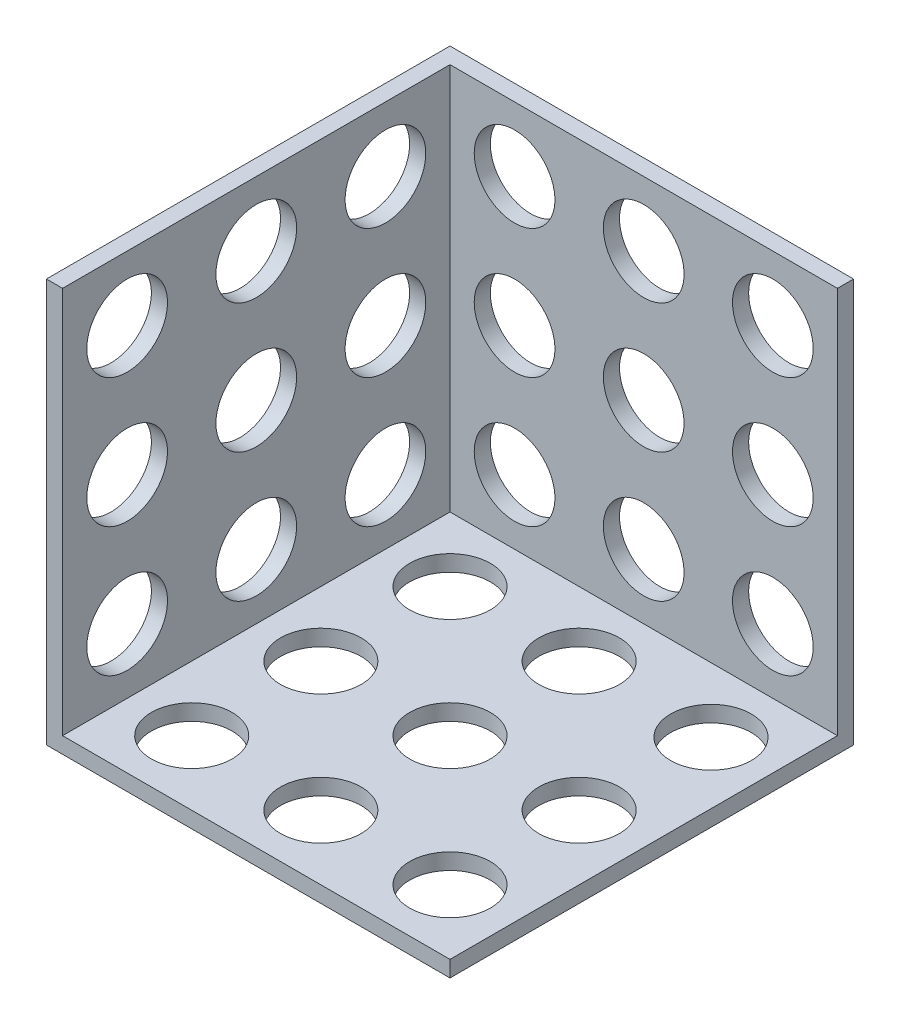
ISO-10303-21;
HEADER;
FILE_DESCRIPTION(('STEP AP214'),'2;1');
FILE_NAME('part.step','',(''),(''),'','','');
FILE_SCHEMA(('AUTOMOTIVE_DESIGN { 1 0 10303 214 1 1 1 1 }'));
ENDSEC;
DATA;
#1=APPLICATION_CONTEXT('core data for automotive mechanical design processes');
#2=APPLICATION_PROTOCOL_DEFINITION('international standard','automotive_design',2000,#1);
#3=PRODUCT_CONTEXT('',#1,'mechanical');
#4=PRODUCT('Part','Part','',(#3));
#5=PRODUCT_RELATED_PRODUCT_CATEGORY('part','',(#4));
#6=PRODUCT_DEFINITION_FORMATION('','',#4);
#7=PRODUCT_DEFINITION_CONTEXT('part definition',#1,'design');
#8=PRODUCT_DEFINITION('design','',#6,#7);
#9=PRODUCT_DEFINITION_SHAPE('','',#8);
#10=(LENGTH_UNIT() NAMED_UNIT(*) SI_UNIT(.MILLI.,.METRE.));
#11=(NAMED_UNIT(*) PLANE_ANGLE_UNIT() SI_UNIT($,.RADIAN.));
#12=(NAMED_UNIT(*) SI_UNIT($,.STERADIAN.) SOLID_ANGLE_UNIT());
#13=UNCERTAINTY_MEASURE_WITH_UNIT(LENGTH_MEASURE(1.E-05),#10,'distance_accuracy_value','');
#14=(GEOMETRIC_REPRESENTATION_CONTEXT(3) GLOBAL_UNCERTAINTY_ASSIGNED_CONTEXT((#13)) GLOBAL_UNIT_ASSIGNED_CONTEXT((#10,
#11,#12)) REPRESENTATION_CONTEXT('',''));
#15=CARTESIAN_POINT('',(0.,0.,0.));
#16=DIRECTION('',(0.,0.,1.));
#17=DIRECTION('',(1.,0.,0.));
#18=AXIS2_PLACEMENT_3D('',#15,#16,#17);
#19=CARTESIAN_POINT('',(240.,10.,0.));
#20=DIRECTION('',(-1.,0.,0.));
#21=DIRECTION('',(0.,0.,1.));
#22=AXIS2_PLACEMENT_3D('',#19,#20,#21);
#23=PLANE('',#22);
#24=DIRECTION('',(0.,0.,-1.));
#25=VECTOR('',#24,1.);
#26=CARTESIAN_POINT('',(240.,0.,0.));
#27=LINE('',#26,#25);
#28=CARTESIAN_POINT('',(240.,0.,80.));
#29=VERTEX_POINT('',#28);
#30=CARTESIAN_POINT('',(240.,0.,-170.));
#31=VERTEX_POINT('',#30);
#32=EDGE_CURVE('E196',#29,#31,#27,.T.);
#33=ORIENTED_EDGE('',*,*,#32,.T.);
#34=DIRECTION('',(0.,1.,0.));
#35=VECTOR('',#34,1.);
#36=CARTESIAN_POINT('',(240.,-4.16333634234434E-13,-170.));
#37=LINE('',#36,#35);
#38=CARTESIAN_POINT('',(240.,250.,-170.));
#39=VERTEX_POINT('',#38);
#40=EDGE_CURVE('E200',#31,#39,#37,.T.);
#41=ORIENTED_EDGE('',*,*,#40,.T.);
#42=DIRECTION('',(0.,0.,1.));
#43=VECTOR('',#42,1.);
#44=CARTESIAN_POINT('',(240.,250.,-170.));
#45=LINE('',#44,#43);
#46=CARTESIAN_POINT('',(240.,250.,-160.));
#47=VERTEX_POINT('',#46);
#48=EDGE_CURVE('E204',#39,#47,#45,.T.);
#49=ORIENTED_EDGE('',*,*,#48,.T.);
#50=DIRECTION('',(0.,1.,0.));
#51=VECTOR('',#50,1.);
#52=CARTESIAN_POINT('',(240.,-4.16333634234434E-13,-160.));
#53=LINE('',#52,#51);
#54=CARTESIAN_POINT('',(240.,10.,-160.));
#55=VERTEX_POINT('',#54);
#56=EDGE_CURVE('E250',#55,#47,#53,.T.);
#57=ORIENTED_EDGE('',*,*,#56,.F.);
#58=DIRECTION('',(0.,0.,-1.));
#59=VECTOR('',#58,1.);
#60=CARTESIAN_POINT('',(240.,10.,0.));
#61=LINE('',#60,#59);
#62=CARTESIAN_POINT('',(240.,10.,80.));
#63=VERTEX_POINT('',#62);
#64=EDGE_CURVE('E262',#63,#55,#61,.T.);
#65=ORIENTED_EDGE('',*,*,#64,.F.);
#66=DIRECTION('',(0.,-1.,0.));
#67=VECTOR('',#66,1.);
#68=CARTESIAN_POINT('',(240.,10.,80.));
#69=LINE('',#68,#67);
#70=EDGE_CURVE('E11',#63,#29,#69,.T.);
#71=ORIENTED_EDGE('',*,*,#70,.T.);
#72=EDGE_LOOP('',(#33,#41,#49,#57,#65,#71));
#73=FACE_BOUND('',#72,.T.);
#74=ADVANCED_FACE('F35',(#73),#23,.F.);
#75=CARTESIAN_POINT('',(200.,10.,-40.));
#76=DIRECTION('',(0.,-1.,0.));
#77=DIRECTION('',(0.,0.,-1.));
#78=AXIS2_PLACEMENT_3D('',#75,#76,#77);
#79=CYLINDRICAL_SURFACE('',#78,25.);
#80=CARTESIAN_POINT('',(200.,10.,-40.));
#81=DIRECTION('',(0.,1.,0.));
#82=DIRECTION('',(0.,0.,1.));
#83=AXIS2_PLACEMENT_3D('',#80,#81,#82);
#84=CIRCLE('',#83,25.);
#85=CARTESIAN_POINT('',(200.,10.,-15.));
#86=VERTEX_POINT('',#85);
#87=EDGE_CURVE('E297',#86,#86,#84,.T.);
#88=ORIENTED_EDGE('',*,*,#87,.T.);
#89=EDGE_LOOP('',(#88));
#90=FACE_BOUND('',#89,.T.);
#91=CARTESIAN_POINT('',(200.,0.,-40.));
#92=DIRECTION('',(0.,1.,0.));
#93=DIRECTION('',(0.,0.,1.));
#94=AXIS2_PLACEMENT_3D('',#91,#92,#93);
#95=CIRCLE('',#94,25.);
#96=CARTESIAN_POINT('',(200.,0.,-15.));
#97=VERTEX_POINT('',#96);
#98=EDGE_CURVE('E324',#97,#97,#95,.T.);
#99=ORIENTED_EDGE('',*,*,#98,.F.);
#100=EDGE_LOOP('',(#99));
#101=FACE_BOUND('',#100,.T.);
#102=ADVANCED_FACE('F186',(#90,#101),#79,.F.);
#103=CARTESIAN_POINT('',(120.,10.,-120.));
#104=DIRECTION('',(0.,-1.,0.));
#105=DIRECTION('',(0.,0.,-1.));
#106=AXIS2_PLACEMENT_3D('',#103,#104,#105);
#107=CYLINDRICAL_SURFACE('',#106,25.);
#108=CARTESIAN_POINT('',(120.,10.,-120.));
#109=DIRECTION('',(0.,1.,0.));
#110=DIRECTION('',(0.,0.,1.));
#111=AXIS2_PLACEMENT_3D('',#108,#109,#110);
#112=CIRCLE('',#111,25.);
#113=CARTESIAN_POINT('',(120.,10.,-94.9999999999999));
#114=VERTEX_POINT('',#113);
#115=EDGE_CURVE('E294',#114,#114,#112,.T.);
#116=ORIENTED_EDGE('',*,*,#115,.T.);
#117=EDGE_LOOP('',(#116));
#118=FACE_BOUND('',#117,.T.);
#119=CARTESIAN_POINT('',(120.,0.,-120.));
#120=DIRECTION('',(0.,1.,0.));
#121=DIRECTION('',(0.,0.,1.));
#122=AXIS2_PLACEMENT_3D('',#119,#120,#121);
#123=CIRCLE('',#122,25.);
#124=CARTESIAN_POINT('',(120.,0.,-94.9999999999999));
#125=VERTEX_POINT('',#124);
#126=EDGE_CURVE('E321',#125,#125,#123,.T.);
#127=ORIENTED_EDGE('',*,*,#126,.F.);
#128=EDGE_LOOP('',(#127));
#129=FACE_BOUND('',#128,.T.);
#130=ADVANCED_FACE('F191',(#118,#129),#107,.F.);
#131=CARTESIAN_POINT('',(200.,10.,40.));
#132=DIRECTION('',(0.,-1.,0.));
#133=DIRECTION('',(0.,0.,-1.));
#134=AXIS2_PLACEMENT_3D('',#131,#132,#133);
#135=CYLINDRICAL_SURFACE('',#134,25.);
#136=CARTESIAN_POINT('',(200.,10.,40.));
#137=DIRECTION('',(0.,1.,0.));
#138=DIRECTION('',(0.,0.,1.));
#139=AXIS2_PLACEMENT_3D('',#136,#137,#138);
#140=CIRCLE('',#139,25.);
#141=CARTESIAN_POINT('',(200.,10.,65.));
#142=VERTEX_POINT('',#141);
#143=EDGE_CURVE('E291',#142,#142,#140,.T.);
#144=ORIENTED_EDGE('',*,*,#143,.T.);
#145=EDGE_LOOP('',(#144));
#146=FACE_BOUND('',#145,.T.);
#147=CARTESIAN_POINT('',(200.,0.,40.));
#148=DIRECTION('',(0.,1.,0.));
#149=DIRECTION('',(0.,0.,1.));
#150=AXIS2_PLACEMENT_3D('',#147,#148,#149);
#151=CIRCLE('',#150,25.);
#152=CARTESIAN_POINT('',(200.,0.,65.));
#153=VERTEX_POINT('',#152);
#154=EDGE_CURVE('E318',#153,#153,#151,.T.);
#155=ORIENTED_EDGE('',*,*,#154,.F.);
#156=EDGE_LOOP('',(#155));
#157=FACE_BOUND('',#156,.T.);
#158=ADVANCED_FACE('F345',(#146,#157),#135,.F.);
#159=CARTESIAN_POINT('',(120.,10.,-40.));
#160=DIRECTION('',(0.,-1.,0.));
#161=DIRECTION('',(0.,0.,-1.));
#162=AXIS2_PLACEMENT_3D('',#159,#160,#161);
#163=CYLINDRICAL_SURFACE('',#162,25.);
#164=CARTESIAN_POINT('',(120.,10.,-40.));
#165=DIRECTION('',(0.,1.,0.));
#166=DIRECTION('',(0.,0.,1.));
#167=AXIS2_PLACEMENT_3D('',#164,#165,#166);
#168=CIRCLE('',#167,25.);
#169=CARTESIAN_POINT('',(120.,10.,-15.));
#170=VERTEX_POINT('',#169);
#171=EDGE_CURVE('E288',#170,#170,#168,.T.);
#172=ORIENTED_EDGE('',*,*,#171,.T.);
#173=EDGE_LOOP('',(#172));
#174=FACE_BOUND('',#173,.T.);
#175=CARTESIAN_POINT('',(120.,0.,-40.));
#176=DIRECTION('',(0.,1.,0.));
#177=DIRECTION('',(0.,0.,1.));
#178=AXIS2_PLACEMENT_3D('',#175,#176,#177);
#179=CIRCLE('',#178,25.);
#180=CARTESIAN_POINT('',(120.,0.,-15.));
#181=VERTEX_POINT('',#180);
#182=EDGE_CURVE('E315',#181,#181,#179,.T.);
#183=ORIENTED_EDGE('',*,*,#182,.F.);
#184=EDGE_LOOP('',(#183));
#185=FACE_BOUND('',#184,.T.);
#186=ADVANCED_FACE('F349',(#174,#185),#163,.F.);
#187=CARTESIAN_POINT('',(40.,10.,-120.));
#188=DIRECTION('',(0.,-1.,0.));
#189=DIRECTION('',(0.,0.,-1.));
#190=AXIS2_PLACEMENT_3D('',#187,#188,#189);
#191=CYLINDRICAL_SURFACE('',#190,25.);
#192=CARTESIAN_POINT('',(40.,10.,-120.));
#193=DIRECTION('',(0.,1.,0.));
#194=DIRECTION('',(0.,0.,1.));
#195=AXIS2_PLACEMENT_3D('',#192,#193,#194);
#196=CIRCLE('',#195,25.);
#197=CARTESIAN_POINT('',(40.,10.,-94.9999999999999));
#198=VERTEX_POINT('',#197);
#199=EDGE_CURVE('E283',#198,#198,#196,.T.);
#200=ORIENTED_EDGE('',*,*,#199,.T.);
#201=EDGE_LOOP('',(#200));
#202=FACE_BOUND('',#201,.T.);
#203=CARTESIAN_POINT('',(40.,0.,-120.));
#204=DIRECTION('',(0.,1.,0.));
#205=DIRECTION('',(0.,0.,1.));
#206=AXIS2_PLACEMENT_3D('',#203,#204,#205);
#207=CIRCLE('',#206,25.);
#208=CARTESIAN_POINT('',(40.,0.,-94.9999999999999));
#209=VERTEX_POINT('',#208);
#210=EDGE_CURVE('E312',#209,#209,#207,.T.);
#211=ORIENTED_EDGE('',*,*,#210,.F.);
#212=EDGE_LOOP('',(#211));
#213=FACE_BOUND('',#212,.T.);
#214=ADVANCED_FACE('F353',(#202,#213),#191,.F.);
#215=CARTESIAN_POINT('',(120.,10.,40.));
#216=DIRECTION('',(0.,-1.,0.));
#217=DIRECTION('',(0.,0.,-1.));
#218=AXIS2_PLACEMENT_3D('',#215,#216,#217);
#219=CYLINDRICAL_SURFACE('',#218,25.);
#220=CARTESIAN_POINT('',(120.,10.,40.));
#221=DIRECTION('',(0.,1.,0.));
#222=DIRECTION('',(0.,0.,1.));
#223=AXIS2_PLACEMENT_3D('',#220,#221,#222);
#224=CIRCLE('',#223,25.);
#225=CARTESIAN_POINT('',(120.,10.,65.));
#226=VERTEX_POINT('',#225);
#227=EDGE_CURVE('E279',#226,#226,#224,.T.);
#228=ORIENTED_EDGE('',*,*,#227,.T.);
#229=EDGE_LOOP('',(#228));
#230=FACE_BOUND('',#229,.T.);
#231=CARTESIAN_POINT('',(120.,0.,40.));
#232=DIRECTION('',(0.,1.,0.));
#233=DIRECTION('',(0.,0.,1.));
#234=AXIS2_PLACEMENT_3D('',#231,#232,#233);
#235=CIRCLE('',#234,25.);
#236=CARTESIAN_POINT('',(120.,0.,65.));
#237=VERTEX_POINT('',#236);
#238=EDGE_CURVE('E309',#237,#237,#235,.T.);
#239=ORIENTED_EDGE('',*,*,#238,.F.);
#240=EDGE_LOOP('',(#239));
#241=FACE_BOUND('',#240,.T.);
#242=ADVANCED_FACE('F357',(#230,#241),#219,.F.);
#243=CARTESIAN_POINT('',(40.,10.,-40.));
#244=DIRECTION('',(0.,-1.,0.));
#245=DIRECTION('',(0.,0.,-1.));
#246=AXIS2_PLACEMENT_3D('',#243,#244,#245);
#247=CYLINDRICAL_SURFACE('',#246,25.);
#248=CARTESIAN_POINT('',(40.,10.,-40.));
#249=DIRECTION('',(0.,1.,0.));
#250=DIRECTION('',(0.,0.,1.));
#251=AXIS2_PLACEMENT_3D('',#248,#249,#250);
#252=CIRCLE('',#251,25.);
#253=CARTESIAN_POINT('',(40.,10.,-15.));
#254=VERTEX_POINT('',#253);
#255=EDGE_CURVE('E275',#254,#254,#252,.T.);
#256=ORIENTED_EDGE('',*,*,#255,.T.);
#257=EDGE_LOOP('',(#256));
#258=FACE_BOUND('',#257,.T.);
#259=CARTESIAN_POINT('',(40.,0.,-40.));
#260=DIRECTION('',(0.,1.,0.));
#261=DIRECTION('',(0.,0.,1.));
#262=AXIS2_PLACEMENT_3D('',#259,#260,#261);
#263=CIRCLE('',#262,25.);
#264=CARTESIAN_POINT('',(40.,0.,-15.));
#265=VERTEX_POINT('',#264);
#266=EDGE_CURVE('E306',#265,#265,#263,.T.);
#267=ORIENTED_EDGE('',*,*,#266,.F.);
#268=EDGE_LOOP('',(#267));
#269=FACE_BOUND('',#268,.T.);
#270=ADVANCED_FACE('F361',(#258,#269),#247,.F.);
#271=CARTESIAN_POINT('',(40.,10.,40.));
#272=DIRECTION('',(0.,-1.,0.));
#273=DIRECTION('',(0.,0.,-1.));
#274=AXIS2_PLACEMENT_3D('',#271,#272,#273);
#275=CYLINDRICAL_SURFACE('',#274,25.);
#276=CARTESIAN_POINT('',(40.,10.,40.));
#277=DIRECTION('',(0.,1.,0.));
#278=DIRECTION('',(0.,0.,1.));
#279=AXIS2_PLACEMENT_3D('',#276,#277,#278);
#280=CIRCLE('',#279,25.);
#281=CARTESIAN_POINT('',(40.,10.,65.));
#282=VERTEX_POINT('',#281);
#283=EDGE_CURVE('E255',#282,#282,#280,.T.);
#284=ORIENTED_EDGE('',*,*,#283,.T.);
#285=EDGE_LOOP('',(#284));
#286=FACE_BOUND('',#285,.T.);
#287=CARTESIAN_POINT('',(40.,0.,40.));
#288=DIRECTION('',(0.,1.,0.));
#289=DIRECTION('',(0.,0.,1.));
#290=AXIS2_PLACEMENT_3D('',#287,#288,#289);
#291=CIRCLE('',#290,25.);
#292=CARTESIAN_POINT('',(40.,0.,65.));
#293=VERTEX_POINT('',#292);
#294=EDGE_CURVE('E303',#293,#293,#291,.T.);
#295=ORIENTED_EDGE('',*,*,#294,.F.);
#296=EDGE_LOOP('',(#295));
#297=FACE_BOUND('',#296,.T.);
#298=ADVANCED_FACE('F340',(#286,#297),#275,.F.);
#299=CARTESIAN_POINT('',(0.,10.,80.));
#300=DIRECTION('',(0.,0.,-1.));
#301=DIRECTION('',(-1.,0.,0.));
#302=AXIS2_PLACEMENT_3D('',#299,#300,#301);
#303=PLANE('',#302);
#304=DIRECTION('',(1.,0.,0.));
#305=VECTOR('',#304,1.);
#306=CARTESIAN_POINT('',(0.,0.,80.));
#307=LINE('',#306,#305);
#308=CARTESIAN_POINT('',(-10.,0.,80.));
#309=VERTEX_POINT('',#308);
#310=EDGE_CURVE('E203',#309,#29,#307,.T.);
#311=ORIENTED_EDGE('',*,*,#310,.T.);
#312=ORIENTED_EDGE('',*,*,#70,.F.);
#313=DIRECTION('',(1.,0.,0.));
#314=VECTOR('',#313,1.);
#315=CARTESIAN_POINT('',(0.,10.,80.));
#316=LINE('',#315,#314);
#317=CARTESIAN_POINT('',(0.,10.,80.));
#318=VERTEX_POINT('',#317);
#319=EDGE_CURVE('E52',#318,#63,#316,.T.);
#320=ORIENTED_EDGE('',*,*,#319,.F.);
#321=DIRECTION('',(0.,1.,0.));
#322=VECTOR('',#321,1.);
#323=CARTESIAN_POINT('',(0.,0.,80.));
#324=LINE('',#323,#322);
#325=CARTESIAN_POINT('',(0.,249.999999999996,79.999999999999));
#326=VERTEX_POINT('',#325);
#327=EDGE_CURVE('E117',#318,#326,#324,.T.);
#328=ORIENTED_EDGE('',*,*,#327,.T.);
#329=DIRECTION('',(1.,0.,0.));
#330=VECTOR('',#329,1.);
#331=CARTESIAN_POINT('',(-10.,249.999999999996,79.999999999999));
#332=LINE('',#331,#330);
#333=CARTESIAN_POINT('',(-10.,249.999999999996,79.999999999999));
#334=VERTEX_POINT('',#333);
#335=EDGE_CURVE('E96',#334,#326,#332,.T.);
#336=ORIENTED_EDGE('',*,*,#335,.F.);
#337=DIRECTION('',(0.,1.,0.));
#338=VECTOR('',#337,1.);
#339=CARTESIAN_POINT('',(-10.,0.,80.));
#340=LINE('',#339,#338);
#341=EDGE_CURVE('E103',#309,#334,#340,.T.);
#342=ORIENTED_EDGE('',*,*,#341,.F.);
#343=EDGE_LOOP('',(#311,#312,#320,#328,#336,#342));
#344=FACE_BOUND('',#343,.T.);
#345=ADVANCED_FACE('F115',(#344),#303,.F.);
#346=CARTESIAN_POINT('',(201.671071705131,10.,-120.));
#347=DIRECTION('',(0.,-1.,0.));
#348=DIRECTION('',(0.,0.,-1.));
#349=AXIS2_PLACEMENT_3D('',#346,#347,#348);
#350=CYLINDRICAL_SURFACE('',#349,25.);
#351=CARTESIAN_POINT('',(201.671071705131,10.,-120.));
#352=DIRECTION('',(0.,1.,0.));
#353=DIRECTION('',(0.,0.,1.));
#354=AXIS2_PLACEMENT_3D('',#351,#352,#353);
#355=CIRCLE('',#354,25.);
#356=CARTESIAN_POINT('',(201.671071705131,10.,-94.9999999999999));
#357=VERTEX_POINT('',#356);
#358=EDGE_CURVE('E44',#357,#357,#355,.T.);
#359=ORIENTED_EDGE('',*,*,#358,.T.);
#360=EDGE_LOOP('',(#359));
#361=FACE_BOUND('',#360,.T.);
#362=CARTESIAN_POINT('',(201.671071705131,0.,-120.));
#363=DIRECTION('',(0.,1.,0.));
#364=DIRECTION('',(0.,0.,1.));
#365=AXIS2_PLACEMENT_3D('',#362,#363,#364);
#366=CIRCLE('',#365,25.);
#367=CARTESIAN_POINT('',(201.671071705131,0.,-94.9999999999999));
#368=VERTEX_POINT('',#367);
#369=EDGE_CURVE('E265',#368,#368,#366,.T.);
#370=ORIENTED_EDGE('',*,*,#369,.F.);
#371=EDGE_LOOP('',(#370));
#372=FACE_BOUND('',#371,.T.);
#373=ADVANCED_FACE('F330',(#361,#372),#350,.F.);
#374=CARTESIAN_POINT('',(0.,10.,0.));
#375=DIRECTION('',(0.,1.,0.));
#376=DIRECTION('',(0.,0.,1.));
#377=AXIS2_PLACEMENT_3D('',#374,#375,#376);
#378=PLANE('',#377);
#379=ORIENTED_EDGE('',*,*,#64,.T.);
#380=DIRECTION('',(1.,0.,0.));
#381=VECTOR('',#380,1.);
#382=CARTESIAN_POINT('',(0.,10.,-160.));
#383=LINE('',#382,#381);
#384=CARTESIAN_POINT('',(0.,10.,-160.));
#385=VERTEX_POINT('',#384);
#386=EDGE_CURVE('E258',#385,#55,#383,.T.);
#387=ORIENTED_EDGE('',*,*,#386,.F.);
#388=DIRECTION('',(0.,0.,-1.));
#389=VECTOR('',#388,1.);
#390=CARTESIAN_POINT('',(0.,10.,0.));
#391=LINE('',#390,#389);
#392=EDGE_CURVE('E261',#318,#385,#391,.T.);
#393=ORIENTED_EDGE('',*,*,#392,.F.);
#394=ORIENTED_EDGE('',*,*,#319,.T.);
#395=EDGE_LOOP('',(#379,#387,#393,#394));
#396=FACE_BOUND('',#395,.T.);
#397=ORIENTED_EDGE('',*,*,#283,.F.);
#398=EDGE_LOOP('',(#397));
#399=FACE_BOUND('',#398,.T.);
#400=ORIENTED_EDGE('',*,*,#255,.F.);
#401=EDGE_LOOP('',(#400));
#402=FACE_BOUND('',#401,.T.);
#403=ORIENTED_EDGE('',*,*,#227,.F.);
#404=EDGE_LOOP('',(#403));
#405=FACE_BOUND('',#404,.T.);
#406=ORIENTED_EDGE('',*,*,#199,.F.);
#407=EDGE_LOOP('',(#406));
#408=FACE_BOUND('',#407,.T.);
#409=ORIENTED_EDGE('',*,*,#171,.F.);
#410=EDGE_LOOP('',(#409));
#411=FACE_BOUND('',#410,.T.);
#412=ORIENTED_EDGE('',*,*,#143,.F.);
#413=EDGE_LOOP('',(#412));
#414=FACE_BOUND('',#413,.T.);
#415=ORIENTED_EDGE('',*,*,#115,.F.);
#416=EDGE_LOOP('',(#415));
#417=FACE_BOUND('',#416,.T.);
#418=ORIENTED_EDGE('',*,*,#87,.F.);
#419=EDGE_LOOP('',(#418));
#420=FACE_BOUND('',#419,.T.);
#421=ORIENTED_EDGE('',*,*,#358,.F.);
#422=EDGE_LOOP('',(#421));
#423=FACE_BOUND('',#422,.T.);
#424=ADVANCED_FACE('F332',(#396,#399,#402,#405,#408,#411,#414,#417,#420,#423),#378,.T.);
#425=CARTESIAN_POINT('',(0.,0.,0.));
#426=DIRECTION('',(0.,1.,0.));
#427=DIRECTION('',(0.,0.,1.));
#428=AXIS2_PLACEMENT_3D('',#425,#426,#427);
#429=PLANE('',#428);
#430=ORIENTED_EDGE('',*,*,#32,.F.);
#431=ORIENTED_EDGE('',*,*,#310,.F.);
#432=DIRECTION('',(0.,0.,1.));
#433=VECTOR('',#432,1.);
#434=CARTESIAN_POINT('',(-10.,0.,0.));
#435=LINE('',#434,#433);
#436=CARTESIAN_POINT('',(-10.,0.,-170.));
#437=VERTEX_POINT('',#436);
#438=EDGE_CURVE('E110',#437,#309,#435,.T.);
#439=ORIENTED_EDGE('',*,*,#438,.F.);
#440=DIRECTION('',(-1.,0.,0.));
#441=VECTOR('',#440,1.);
#442=CARTESIAN_POINT('',(0.,0.,-170.));
#443=LINE('',#442,#441);
#444=EDGE_CURVE('E206',#31,#437,#443,.T.);
#445=ORIENTED_EDGE('',*,*,#444,.F.);
#446=EDGE_LOOP('',(#430,#431,#439,#445));
#447=FACE_BOUND('',#446,.T.);
#448=ORIENTED_EDGE('',*,*,#294,.T.);
#449=EDGE_LOOP('',(#448));
#450=FACE_BOUND('',#449,.T.);
#451=ORIENTED_EDGE('',*,*,#266,.T.);
#452=EDGE_LOOP('',(#451));
#453=FACE_BOUND('',#452,.T.);
#454=ORIENTED_EDGE('',*,*,#238,.T.);
#455=EDGE_LOOP('',(#454));
#456=FACE_BOUND('',#455,.T.);
#457=ORIENTED_EDGE('',*,*,#210,.T.);
#458=EDGE_LOOP('',(#457));
#459=FACE_BOUND('',#458,.T.);
#460=ORIENTED_EDGE('',*,*,#182,.T.);
#461=EDGE_LOOP('',(#460));
#462=FACE_BOUND('',#461,.T.);
#463=ORIENTED_EDGE('',*,*,#154,.T.);
#464=EDGE_LOOP('',(#463));
#465=FACE_BOUND('',#464,.T.);
#466=ORIENTED_EDGE('',*,*,#126,.T.);
#467=EDGE_LOOP('',(#466));
#468=FACE_BOUND('',#467,.T.);
#469=ORIENTED_EDGE('',*,*,#98,.T.);
#470=EDGE_LOOP('',(#469));
#471=FACE_BOUND('',#470,.T.);
#472=ORIENTED_EDGE('',*,*,#369,.T.);
#473=EDGE_LOOP('',(#472));
#474=FACE_BOUND('',#473,.T.);
#475=ADVANCED_FACE('F207',(#447,#450,#453,#456,#459,#462,#465,#468,#471,#474),#429,.F.);
#476=CARTESIAN_POINT('',(0.,0.,-160.));
#477=DIRECTION('',(0.,0.,-1.));
#478=DIRECTION('',(-1.,0.,0.));
#479=AXIS2_PLACEMENT_3D('',#476,#477,#478);
#480=PLANE('',#479);
#481=CARTESIAN_POINT('',(200.,130.,-160.));
#482=DIRECTION('',(0.,0.,-1.));
#483=DIRECTION('',(-1.,0.,0.));
#484=AXIS2_PLACEMENT_3D('',#481,#482,#483);
#485=CIRCLE('',#484,25.);
#486=CARTESIAN_POINT('',(175.,130.,-160.));
#487=VERTEX_POINT('',#486);
#488=EDGE_CURVE('E252',#487,#487,#485,.T.);
#489=ORIENTED_EDGE('',*,*,#488,.T.);
#490=EDGE_LOOP('',(#489));
#491=FACE_BOUND('',#490,.T.);
#492=CARTESIAN_POINT('',(200.,210.,-160.));
#493=DIRECTION('',(0.,0.,-1.));
#494=DIRECTION('',(-1.,0.,0.));
#495=AXIS2_PLACEMENT_3D('',#492,#493,#494);
#496=CIRCLE('',#495,25.);
#497=CARTESIAN_POINT('',(175.,210.,-160.));
#498=VERTEX_POINT('',#497);
#499=EDGE_CURVE('E446',#498,#498,#496,.T.);
#500=ORIENTED_EDGE('',*,*,#499,.T.);
#501=EDGE_LOOP('',(#500));
#502=FACE_BOUND('',#501,.T.);
#503=CARTESIAN_POINT('',(120.,130.,-160.));
#504=DIRECTION('',(0.,0.,-1.));
#505=DIRECTION('',(-1.,0.,0.));
#506=AXIS2_PLACEMENT_3D('',#503,#504,#505);
#507=CIRCLE('',#506,25.);
#508=CARTESIAN_POINT('',(94.9999999999998,130.,-160.));
#509=VERTEX_POINT('',#508);
#510=EDGE_CURVE('E448',#509,#509,#507,.T.);
#511=ORIENTED_EDGE('',*,*,#510,.T.);
#512=EDGE_LOOP('',(#511));
#513=FACE_BOUND('',#512,.T.);
#514=CARTESIAN_POINT('',(200.,50.,-160.));
#515=DIRECTION('',(0.,0.,-1.));
#516=DIRECTION('',(-1.,0.,0.));
#517=AXIS2_PLACEMENT_3D('',#514,#515,#516);
#518=CIRCLE('',#517,25.);
#519=CARTESIAN_POINT('',(175.,50.,-160.));
#520=VERTEX_POINT('',#519);
#521=EDGE_CURVE('E453',#520,#520,#518,.T.);
#522=ORIENTED_EDGE('',*,*,#521,.T.);
#523=EDGE_LOOP('',(#522));
#524=FACE_BOUND('',#523,.T.);
#525=CARTESIAN_POINT('',(120.,210.,-160.));
#526=DIRECTION('',(0.,0.,-1.));
#527=DIRECTION('',(-1.,0.,0.));
#528=AXIS2_PLACEMENT_3D('',#525,#526,#527);
#529=CIRCLE('',#528,25.);
#530=CARTESIAN_POINT('',(94.9999999999999,210.,-160.));
#531=VERTEX_POINT('',#530);
#532=EDGE_CURVE('E456',#531,#531,#529,.T.);
#533=ORIENTED_EDGE('',*,*,#532,.T.);
#534=EDGE_LOOP('',(#533));
#535=FACE_BOUND('',#534,.T.);
#536=CARTESIAN_POINT('',(40.,130.,-160.));
#537=DIRECTION('',(0.,0.,-1.));
#538=DIRECTION('',(-1.,0.,0.));
#539=AXIS2_PLACEMENT_3D('',#536,#537,#538);
#540=CIRCLE('',#539,25.);
#541=CARTESIAN_POINT('',(14.9999999999999,130.,-160.));
#542=VERTEX_POINT('',#541);
#543=EDGE_CURVE('E459',#542,#542,#540,.T.);
#544=ORIENTED_EDGE('',*,*,#543,.T.);
#545=EDGE_LOOP('',(#544));
#546=FACE_BOUND('',#545,.T.);
#547=CARTESIAN_POINT('',(120.,50.,-160.));
#548=DIRECTION('',(0.,0.,-1.));
#549=DIRECTION('',(-1.,0.,0.));
#550=AXIS2_PLACEMENT_3D('',#547,#548,#549);
#551=CIRCLE('',#550,25.);
#552=CARTESIAN_POINT('',(94.9999999999999,50.,-160.));
#553=VERTEX_POINT('',#552);
#554=EDGE_CURVE('E462',#553,#553,#551,.T.);
#555=ORIENTED_EDGE('',*,*,#554,.T.);
#556=EDGE_LOOP('',(#555));
#557=FACE_BOUND('',#556,.T.);
#558=CARTESIAN_POINT('',(40.,210.,-160.));
#559=DIRECTION('',(0.,0.,-1.));
#560=DIRECTION('',(-1.,0.,0.));
#561=AXIS2_PLACEMENT_3D('',#558,#559,#560);
#562=CIRCLE('',#561,25.);
#563=CARTESIAN_POINT('',(15.,210.,-160.));
#564=VERTEX_POINT('',#563);
#565=EDGE_CURVE('E465',#564,#564,#562,.T.);
#566=ORIENTED_EDGE('',*,*,#565,.T.);
#567=EDGE_LOOP('',(#566));
#568=FACE_BOUND('',#567,.T.);
#569=CARTESIAN_POINT('',(40.,50.,-160.));
#570=DIRECTION('',(0.,0.,-1.));
#571=DIRECTION('',(-1.,0.,0.));
#572=AXIS2_PLACEMENT_3D('',#569,#570,#571);
#573=CIRCLE('',#572,25.);
#574=CARTESIAN_POINT('',(15.,50.,-160.));
#575=VERTEX_POINT('',#574);
#576=EDGE_CURVE('E215',#575,#575,#573,.T.);
#577=ORIENTED_EDGE('',*,*,#576,.T.);
#578=EDGE_LOOP('',(#577));
#579=FACE_BOUND('',#578,.T.);
#580=DIRECTION('',(0.,1.,0.));
#581=VECTOR('',#580,1.);
#582=CARTESIAN_POINT('',(-1.37043154602168E-13,0.,-160.));
#583=LINE('',#582,#581);
#584=CARTESIAN_POINT('',(0.,250.,-160.));
#585=VERTEX_POINT('',#584);
#586=EDGE_CURVE('E119',#385,#585,#583,.T.);
#587=ORIENTED_EDGE('',*,*,#586,.F.);
#588=ORIENTED_EDGE('',*,*,#386,.T.);
#589=ORIENTED_EDGE('',*,*,#56,.T.);
#590=DIRECTION('',(-1.,0.,0.));
#591=VECTOR('',#590,1.);
#592=CARTESIAN_POINT('',(4.336808689942E-13,250.,-160.));
#593=LINE('',#592,#591);
#594=EDGE_CURVE('E123',#47,#585,#593,.T.);
#595=ORIENTED_EDGE('',*,*,#594,.T.);
#596=EDGE_LOOP('',(#587,#588,#589,#595));
#597=FACE_BOUND('',#596,.T.);
#598=ADVANCED_FACE('F372',(#491,#502,#513,#524,#535,#546,#557,#568,#579,#597),#480,.F.);
#599=CARTESIAN_POINT('',(4.336808689942E-13,250.,-170.));
#600=DIRECTION('',(0.,1.,0.));
#601=DIRECTION('',(-1.,0.,0.));
#602=AXIS2_PLACEMENT_3D('',#599,#600,#601);
#603=PLANE('',#602);
#604=ORIENTED_EDGE('',*,*,#594,.F.);
#605=ORIENTED_EDGE('',*,*,#48,.F.);
#606=DIRECTION('',(-1.,0.,0.));
#607=VECTOR('',#606,1.);
#608=CARTESIAN_POINT('',(4.336808689942E-13,250.,-170.));
#609=LINE('',#608,#607);
#610=CARTESIAN_POINT('',(-10.,250.,-170.));
#611=VERTEX_POINT('',#610);
#612=EDGE_CURVE('E98',#39,#611,#609,.T.);
#613=ORIENTED_EDGE('',*,*,#612,.T.);
#614=DIRECTION('',(0.,0.,-1.));
#615=VECTOR('',#614,1.);
#616=CARTESIAN_POINT('',(-10.,250.,0.));
#617=LINE('',#616,#615);
#618=EDGE_CURVE('E90',#334,#611,#617,.T.);
#619=ORIENTED_EDGE('',*,*,#618,.F.);
#620=ORIENTED_EDGE('',*,*,#335,.T.);
#621=DIRECTION('',(0.,0.,-1.));
#622=VECTOR('',#621,1.);
#623=CARTESIAN_POINT('',(0.,250.,0.));
#624=LINE('',#623,#622);
#625=EDGE_CURVE('E133',#326,#585,#624,.T.);
#626=ORIENTED_EDGE('',*,*,#625,.T.);
#627=EDGE_LOOP('',(#604,#605,#613,#619,#620,#626));
#628=FACE_BOUND('',#627,.T.);
#629=ADVANCED_FACE('F93',(#628),#603,.T.);
#630=CARTESIAN_POINT('',(40.,210.,-170.));
#631=DIRECTION('',(0.,0.,1.));
#632=DIRECTION('',(1.,0.,0.));
#633=AXIS2_PLACEMENT_3D('',#630,#631,#632);
#634=CYLINDRICAL_SURFACE('',#633,25.);
#635=CARTESIAN_POINT('',(40.,210.,-170.));
#636=DIRECTION('',(0.,0.,-1.));
#637=DIRECTION('',(-1.,0.,0.));
#638=AXIS2_PLACEMENT_3D('',#635,#636,#637);
#639=CIRCLE('',#638,25.);
#640=CARTESIAN_POINT('',(15.,210.,-170.));
#641=VERTEX_POINT('',#640);
#642=EDGE_CURVE('E237',#641,#641,#639,.T.);
#643=ORIENTED_EDGE('',*,*,#642,.T.);
#644=EDGE_LOOP('',(#643));
#645=FACE_BOUND('',#644,.T.);
#646=ORIENTED_EDGE('',*,*,#565,.F.);
#647=EDGE_LOOP('',(#646));
#648=FACE_BOUND('',#647,.T.);
#649=ADVANCED_FACE('F401',(#645,#648),#634,.F.);
#650=CARTESIAN_POINT('',(120.,50.,-170.));
#651=DIRECTION('',(0.,0.,1.));
#652=DIRECTION('',(1.,0.,0.));
#653=AXIS2_PLACEMENT_3D('',#650,#651,#652);
#654=CYLINDRICAL_SURFACE('',#653,25.);
#655=CARTESIAN_POINT('',(120.,50.,-170.));
#656=DIRECTION('',(0.,0.,-1.));
#657=DIRECTION('',(-1.,0.,0.));
#658=AXIS2_PLACEMENT_3D('',#655,#656,#657);
#659=CIRCLE('',#658,25.);
#660=CARTESIAN_POINT('',(94.9999999999999,50.,-170.));
#661=VERTEX_POINT('',#660);
#662=EDGE_CURVE('E234',#661,#661,#659,.T.);
#663=ORIENTED_EDGE('',*,*,#662,.T.);
#664=EDGE_LOOP('',(#663));
#665=FACE_BOUND('',#664,.T.);
#666=ORIENTED_EDGE('',*,*,#554,.F.);
#667=EDGE_LOOP('',(#666));
#668=FACE_BOUND('',#667,.T.);
#669=ADVANCED_FACE('F414',(#665,#668),#654,.F.);
#670=CARTESIAN_POINT('',(40.,130.,-170.));
#671=DIRECTION('',(0.,0.,1.));
#672=DIRECTION('',(1.,0.,0.));
#673=AXIS2_PLACEMENT_3D('',#670,#671,#672);
#674=CYLINDRICAL_SURFACE('',#673,25.);
#675=CARTESIAN_POINT('',(40.,130.,-170.));
#676=DIRECTION('',(0.,0.,-1.));
#677=DIRECTION('',(-1.,0.,0.));
#678=AXIS2_PLACEMENT_3D('',#675,#676,#677);
#679=CIRCLE('',#678,25.);
#680=CARTESIAN_POINT('',(14.9999999999999,130.,-170.));
#681=VERTEX_POINT('',#680);
#682=EDGE_CURVE('E231',#681,#681,#679,.T.);
#683=ORIENTED_EDGE('',*,*,#682,.T.);
#684=EDGE_LOOP('',(#683));
#685=FACE_BOUND('',#684,.T.);
#686=ORIENTED_EDGE('',*,*,#543,.F.);
#687=EDGE_LOOP('',(#686));
#688=FACE_BOUND('',#687,.T.);
#689=ADVANCED_FACE('F418',(#685,#688),#674,.F.);
#690=CARTESIAN_POINT('',(120.,210.,-170.));
#691=DIRECTION('',(0.,0.,1.));
#692=DIRECTION('',(1.,0.,0.));
#693=AXIS2_PLACEMENT_3D('',#690,#691,#692);
#694=CYLINDRICAL_SURFACE('',#693,25.);
#695=CARTESIAN_POINT('',(120.,210.,-170.));
#696=DIRECTION('',(0.,0.,-1.));
#697=DIRECTION('',(-1.,0.,0.));
#698=AXIS2_PLACEMENT_3D('',#695,#696,#697);
#699=CIRCLE('',#698,25.);
#700=CARTESIAN_POINT('',(94.9999999999999,210.,-170.));
#701=VERTEX_POINT('',#700);
#702=EDGE_CURVE('E228',#701,#701,#699,.T.);
#703=ORIENTED_EDGE('',*,*,#702,.T.);
#704=EDGE_LOOP('',(#703));
#705=FACE_BOUND('',#704,.T.);
#706=ORIENTED_EDGE('',*,*,#532,.F.);
#707=EDGE_LOOP('',(#706));
#708=FACE_BOUND('',#707,.T.);
#709=ADVANCED_FACE('F422',(#705,#708),#694,.F.);
#710=CARTESIAN_POINT('',(200.,50.,-170.));
#711=DIRECTION('',(0.,0.,1.));
#712=DIRECTION('',(1.,0.,0.));
#713=AXIS2_PLACEMENT_3D('',#710,#711,#712);
#714=CYLINDRICAL_SURFACE('',#713,25.);
#715=CARTESIAN_POINT('',(200.,50.,-170.));
#716=DIRECTION('',(0.,0.,-1.));
#717=DIRECTION('',(-1.,0.,0.));
#718=AXIS2_PLACEMENT_3D('',#715,#716,#717);
#719=CIRCLE('',#718,25.);
#720=CARTESIAN_POINT('',(175.,50.,-170.));
#721=VERTEX_POINT('',#720);
#722=EDGE_CURVE('E225',#721,#721,#719,.T.);
#723=ORIENTED_EDGE('',*,*,#722,.T.);
#724=EDGE_LOOP('',(#723));
#725=FACE_BOUND('',#724,.T.);
#726=ORIENTED_EDGE('',*,*,#521,.F.);
#727=EDGE_LOOP('',(#726));
#728=FACE_BOUND('',#727,.T.);
#729=ADVANCED_FACE('F426',(#725,#728),#714,.F.);
#730=CARTESIAN_POINT('',(120.,130.,-170.));
#731=DIRECTION('',(0.,0.,1.));
#732=DIRECTION('',(1.,0.,0.));
#733=AXIS2_PLACEMENT_3D('',#730,#731,#732);
#734=CYLINDRICAL_SURFACE('',#733,25.);
#735=CARTESIAN_POINT('',(120.,130.,-170.));
#736=DIRECTION('',(0.,0.,-1.));
#737=DIRECTION('',(-1.,0.,0.));
#738=AXIS2_PLACEMENT_3D('',#735,#736,#737);
#739=CIRCLE('',#738,25.);
#740=CARTESIAN_POINT('',(94.9999999999998,130.,-170.));
#741=VERTEX_POINT('',#740);
#742=EDGE_CURVE('E222',#741,#741,#739,.T.);
#743=ORIENTED_EDGE('',*,*,#742,.T.);
#744=EDGE_LOOP('',(#743));
#745=FACE_BOUND('',#744,.T.);
#746=ORIENTED_EDGE('',*,*,#510,.F.);
#747=EDGE_LOOP('',(#746));
#748=FACE_BOUND('',#747,.T.);
#749=ADVANCED_FACE('F430',(#745,#748),#734,.F.);
#750=CARTESIAN_POINT('',(200.,210.,-170.));
#751=DIRECTION('',(0.,0.,1.));
#752=DIRECTION('',(1.,0.,0.));
#753=AXIS2_PLACEMENT_3D('',#750,#751,#752);
#754=CYLINDRICAL_SURFACE('',#753,25.);
#755=CARTESIAN_POINT('',(200.,210.,-170.));
#756=DIRECTION('',(0.,0.,-1.));
#757=DIRECTION('',(-1.,0.,0.));
#758=AXIS2_PLACEMENT_3D('',#755,#756,#757);
#759=CIRCLE('',#758,25.);
#760=CARTESIAN_POINT('',(175.,210.,-170.));
#761=VERTEX_POINT('',#760);
#762=EDGE_CURVE('E219',#761,#761,#759,.T.);
#763=ORIENTED_EDGE('',*,*,#762,.T.);
#764=EDGE_LOOP('',(#763));
#765=FACE_BOUND('',#764,.T.);
#766=ORIENTED_EDGE('',*,*,#499,.F.);
#767=EDGE_LOOP('',(#766));
#768=FACE_BOUND('',#767,.T.);
#769=ADVANCED_FACE('F434',(#765,#768),#754,.F.);
#770=CARTESIAN_POINT('',(200.,130.,-170.));
#771=DIRECTION('',(0.,0.,1.));
#772=DIRECTION('',(1.,0.,0.));
#773=AXIS2_PLACEMENT_3D('',#770,#771,#772);
#774=CYLINDRICAL_SURFACE('',#773,25.);
#775=CARTESIAN_POINT('',(200.,130.,-170.));
#776=DIRECTION('',(0.,0.,-1.));
#777=DIRECTION('',(-1.,0.,0.));
#778=AXIS2_PLACEMENT_3D('',#775,#776,#777);
#779=CIRCLE('',#778,25.);
#780=CARTESIAN_POINT('',(175.,130.,-170.));
#781=VERTEX_POINT('',#780);
#782=EDGE_CURVE('E210',#781,#781,#779,.T.);
#783=ORIENTED_EDGE('',*,*,#782,.T.);
#784=EDGE_LOOP('',(#783));
#785=FACE_BOUND('',#784,.T.);
#786=ORIENTED_EDGE('',*,*,#488,.F.);
#787=EDGE_LOOP('',(#786));
#788=FACE_BOUND('',#787,.T.);
#789=ADVANCED_FACE('F410',(#785,#788),#774,.F.);
#790=CARTESIAN_POINT('',(40.,50.,-170.));
#791=DIRECTION('',(0.,0.,1.));
#792=DIRECTION('',(1.,0.,0.));
#793=AXIS2_PLACEMENT_3D('',#790,#791,#792);
#794=CYLINDRICAL_SURFACE('',#793,25.);
#795=CARTESIAN_POINT('',(40.,50.,-170.));
#796=DIRECTION('',(0.,0.,-1.));
#797=DIRECTION('',(-1.,0.,0.));
#798=AXIS2_PLACEMENT_3D('',#795,#796,#797);
#799=CIRCLE('',#798,25.);
#800=CARTESIAN_POINT('',(15.,50.,-170.));
#801=VERTEX_POINT('',#800);
#802=EDGE_CURVE('E240',#801,#801,#799,.T.);
#803=ORIENTED_EDGE('',*,*,#802,.T.);
#804=EDGE_LOOP('',(#803));
#805=FACE_BOUND('',#804,.T.);
#806=ORIENTED_EDGE('',*,*,#576,.F.);
#807=EDGE_LOOP('',(#806));
#808=FACE_BOUND('',#807,.T.);
#809=ADVANCED_FACE('F407',(#805,#808),#794,.F.);
#810=CARTESIAN_POINT('',(0.,0.,-170.));
#811=DIRECTION('',(0.,0.,-1.));
#812=DIRECTION('',(-1.,0.,0.));
#813=AXIS2_PLACEMENT_3D('',#810,#811,#812);
#814=PLANE('',#813);
#815=ORIENTED_EDGE('',*,*,#444,.T.);
#816=DIRECTION('',(0.,-1.,0.));
#817=VECTOR('',#816,1.);
#818=CARTESIAN_POINT('',(-10.,0.,-170.));
#819=LINE('',#818,#817);
#820=EDGE_CURVE('E102',#611,#437,#819,.T.);
#821=ORIENTED_EDGE('',*,*,#820,.F.);
#822=ORIENTED_EDGE('',*,*,#612,.F.);
#823=ORIENTED_EDGE('',*,*,#40,.F.);
#824=EDGE_LOOP('',(#815,#821,#822,#823));
#825=FACE_BOUND('',#824,.T.);
#826=ORIENTED_EDGE('',*,*,#782,.F.);
#827=EDGE_LOOP('',(#826));
#828=FACE_BOUND('',#827,.T.);
#829=ORIENTED_EDGE('',*,*,#762,.F.);
#830=EDGE_LOOP('',(#829));
#831=FACE_BOUND('',#830,.T.);
#832=ORIENTED_EDGE('',*,*,#742,.F.);
#833=EDGE_LOOP('',(#832));
#834=FACE_BOUND('',#833,.T.);
#835=ORIENTED_EDGE('',*,*,#722,.F.);
#836=EDGE_LOOP('',(#835));
#837=FACE_BOUND('',#836,.T.);
#838=ORIENTED_EDGE('',*,*,#702,.F.);
#839=EDGE_LOOP('',(#838));
#840=FACE_BOUND('',#839,.T.);
#841=ORIENTED_EDGE('',*,*,#682,.F.);
#842=EDGE_LOOP('',(#841));
#843=FACE_BOUND('',#842,.T.);
#844=ORIENTED_EDGE('',*,*,#662,.F.);
#845=EDGE_LOOP('',(#844));
#846=FACE_BOUND('',#845,.T.);
#847=ORIENTED_EDGE('',*,*,#642,.F.);
#848=EDGE_LOOP('',(#847));
#849=FACE_BOUND('',#848,.T.);
#850=ORIENTED_EDGE('',*,*,#802,.F.);
#851=EDGE_LOOP('',(#850));
#852=FACE_BOUND('',#851,.T.);
#853=ADVANCED_FACE('F212',(#825,#828,#831,#834,#837,#840,#843,#846,#849,#852),#814,.T.);
#854=CARTESIAN_POINT('',(0.,0.,0.));
#855=DIRECTION('',(-1.,0.,0.));
#856=DIRECTION('',(0.,0.,1.));
#857=AXIS2_PLACEMENT_3D('',#854,#855,#856);
#858=PLANE('',#857);
#859=CARTESIAN_POINT('',(0.,49.9999999999998,-120.));
#860=DIRECTION('',(-1.,0.,0.));
#861=DIRECTION('',(0.,0.,1.));
#862=AXIS2_PLACEMENT_3D('',#859,#860,#861);
#863=CIRCLE('',#862,25.0000000000017);
#864=CARTESIAN_POINT('',(0.,49.9999999999998,-94.9999999999984));
#865=VERTEX_POINT('',#864);
#866=EDGE_CURVE('E140',#865,#865,#863,.T.);
#867=ORIENTED_EDGE('',*,*,#866,.T.);
#868=EDGE_LOOP('',(#867));
#869=FACE_BOUND('',#868,.T.);
#870=CARTESIAN_POINT('',(0.,129.999999999999,-120.));
#871=DIRECTION('',(-1.,0.,0.));
#872=DIRECTION('',(0.,0.,1.));
#873=AXIS2_PLACEMENT_3D('',#870,#871,#872);
#874=CIRCLE('',#873,25.0000000000014);
#875=CARTESIAN_POINT('',(0.,129.999999999999,-94.9999999999987));
#876=VERTEX_POINT('',#875);
#877=EDGE_CURVE('E143',#876,#876,#874,.T.);
#878=ORIENTED_EDGE('',*,*,#877,.T.);
#879=EDGE_LOOP('',(#878));
#880=FACE_BOUND('',#879,.T.);
#881=CARTESIAN_POINT('',(0.,49.9999999999998,-40.0000000000005));
#882=DIRECTION('',(-1.,0.,0.));
#883=DIRECTION('',(0.,0.,1.));
#884=AXIS2_PLACEMENT_3D('',#881,#882,#883);
#885=CIRCLE('',#884,24.9999999999984);
#886=CARTESIAN_POINT('',(0.,49.9999999999998,-15.0000000000021));
#887=VERTEX_POINT('',#886);
#888=EDGE_CURVE('E146',#887,#887,#885,.T.);
#889=ORIENTED_EDGE('',*,*,#888,.T.);
#890=EDGE_LOOP('',(#889));
#891=FACE_BOUND('',#890,.T.);
#892=CARTESIAN_POINT('',(0.,209.999999999999,-120.));
#893=DIRECTION('',(-1.,0.,0.));
#894=DIRECTION('',(0.,0.,1.));
#895=AXIS2_PLACEMENT_3D('',#892,#893,#894);
#896=CIRCLE('',#895,25.0000000000034);
#897=CARTESIAN_POINT('',(0.,209.999999999999,-94.9999999999966));
#898=VERTEX_POINT('',#897);
#899=EDGE_CURVE('E149',#898,#898,#896,.T.);
#900=ORIENTED_EDGE('',*,*,#899,.T.);
#901=EDGE_LOOP('',(#900));
#902=FACE_BOUND('',#901,.T.);
#903=CARTESIAN_POINT('',(0.,49.9999999999998,39.9999999999992));
#904=DIRECTION('',(-1.,0.,0.));
#905=DIRECTION('',(0.,0.,1.));
#906=AXIS2_PLACEMENT_3D('',#903,#904,#905);
#907=CIRCLE('',#906,24.9999999999954);
#908=CARTESIAN_POINT('',(0.,49.9999999999998,64.9999999999945));
#909=VERTEX_POINT('',#908);
#910=EDGE_CURVE('E152',#909,#909,#907,.T.);
#911=ORIENTED_EDGE('',*,*,#910,.T.);
#912=EDGE_LOOP('',(#911));
#913=FACE_BOUND('',#912,.T.);
#914=CARTESIAN_POINT('',(0.,129.999999999999,-40.0000000000005));
#915=DIRECTION('',(-1.,0.,0.));
#916=DIRECTION('',(0.,0.,1.));
#917=AXIS2_PLACEMENT_3D('',#914,#915,#916);
#918=CIRCLE('',#917,25.0000000000004);
#919=CARTESIAN_POINT('',(0.,129.999999999999,-15.));
#920=VERTEX_POINT('',#919);
#921=EDGE_CURVE('E155',#920,#920,#918,.T.);
#922=ORIENTED_EDGE('',*,*,#921,.T.);
#923=EDGE_LOOP('',(#922));
#924=FACE_BOUND('',#923,.T.);
#925=CARTESIAN_POINT('',(0.,209.999999999999,-40.0000000000005));
#926=DIRECTION('',(-1.,0.,0.));
#927=DIRECTION('',(0.,0.,1.));
#928=AXIS2_PLACEMENT_3D('',#925,#926,#927);
#929=CIRCLE('',#928,25.0000000000001);
#930=CARTESIAN_POINT('',(0.,209.999999999999,-15.0000000000004));
#931=VERTEX_POINT('',#930);
#932=EDGE_CURVE('E158',#931,#931,#929,.T.);
#933=ORIENTED_EDGE('',*,*,#932,.T.);
#934=EDGE_LOOP('',(#933));
#935=FACE_BOUND('',#934,.T.);
#936=CARTESIAN_POINT('',(0.,129.999999999998,39.9999999999992));
#937=DIRECTION('',(-1.,0.,0.));
#938=DIRECTION('',(0.,0.,1.));
#939=AXIS2_PLACEMENT_3D('',#936,#937,#938);
#940=CIRCLE('',#939,24.9999999999931);
#941=CARTESIAN_POINT('',(0.,129.999999999998,64.9999999999923));
#942=VERTEX_POINT('',#941);
#943=EDGE_CURVE('E160',#942,#942,#940,.T.);
#944=ORIENTED_EDGE('',*,*,#943,.T.);
#945=EDGE_LOOP('',(#944));
#946=FACE_BOUND('',#945,.T.);
#947=CARTESIAN_POINT('',(0.,209.999999999999,39.9999999999992));
#948=DIRECTION('',(-1.,0.,0.));
#949=DIRECTION('',(0.,0.,1.));
#950=AXIS2_PLACEMENT_3D('',#947,#948,#949);
#951=CIRCLE('',#950,24.9999999999971);
#952=CARTESIAN_POINT('',(0.,209.999999999999,64.9999999999963));
#953=VERTEX_POINT('',#952);
#954=EDGE_CURVE('E113',#953,#953,#951,.T.);
#955=ORIENTED_EDGE('',*,*,#954,.T.);
#956=EDGE_LOOP('',(#955));
#957=FACE_BOUND('',#956,.T.);
#958=ORIENTED_EDGE('',*,*,#327,.F.);
#959=ORIENTED_EDGE('',*,*,#392,.T.);
#960=ORIENTED_EDGE('',*,*,#586,.T.);
#961=ORIENTED_EDGE('',*,*,#625,.F.);
#962=EDGE_LOOP('',(#958,#959,#960,#961));
#963=FACE_BOUND('',#962,.T.);
#964=ADVANCED_FACE('F167',(#869,#880,#891,#902,#913,#924,#935,#946,#957,#963),#858,.F.);
#965=CARTESIAN_POINT('',(-10.,129.999999999998,39.9999999999992));
#966=DIRECTION('',(1.,0.,0.));
#967=DIRECTION('',(0.,0.,-1.));
#968=AXIS2_PLACEMENT_3D('',#965,#966,#967);
#969=CYLINDRICAL_SURFACE('',#968,24.9999999999931);
#970=CARTESIAN_POINT('',(-10.,129.999999999998,39.9999999999992));
#971=DIRECTION('',(-1.,0.,0.));
#972=DIRECTION('',(0.,0.,1.));
#973=AXIS2_PLACEMENT_3D('',#970,#971,#972);
#974=CIRCLE('',#973,24.9999999999931);
#975=CARTESIAN_POINT('',(-10.,129.999999999998,64.9999999999923));
#976=VERTEX_POINT('',#975);
#977=EDGE_CURVE('E126',#976,#976,#974,.T.);
#978=ORIENTED_EDGE('',*,*,#977,.T.);
#979=EDGE_LOOP('',(#978));
#980=FACE_BOUND('',#979,.T.);
#981=ORIENTED_EDGE('',*,*,#943,.F.);
#982=EDGE_LOOP('',(#981));
#983=FACE_BOUND('',#982,.T.);
#984=ADVANCED_FACE('F491',(#980,#983),#969,.F.);
#985=CARTESIAN_POINT('',(-10.,209.999999999999,-40.0000000000005));
#986=DIRECTION('',(1.,0.,0.));
#987=DIRECTION('',(0.,0.,-1.));
#988=AXIS2_PLACEMENT_3D('',#985,#986,#987);
#989=CYLINDRICAL_SURFACE('',#988,25.0000000000001);
#990=CARTESIAN_POINT('',(-10.,209.999999999999,-40.0000000000005));
#991=DIRECTION('',(-1.,0.,0.));
#992=DIRECTION('',(0.,0.,1.));
#993=AXIS2_PLACEMENT_3D('',#990,#991,#992);
#994=CIRCLE('',#993,25.0000000000001);
#995=CARTESIAN_POINT('',(-10.,209.999999999999,-15.0000000000004));
#996=VERTEX_POINT('',#995);
#997=EDGE_CURVE('E563',#996,#996,#994,.T.);
#998=ORIENTED_EDGE('',*,*,#997,.T.);
#999=EDGE_LOOP('',(#998));
#1000=FACE_BOUND('',#999,.T.);
#1001=ORIENTED_EDGE('',*,*,#932,.F.);
#1002=EDGE_LOOP('',(#1001));
#1003=FACE_BOUND('',#1002,.T.);
#1004=ADVANCED_FACE('F497',(#1000,#1003),#989,.F.);
#1005=CARTESIAN_POINT('',(-10.,129.999999999999,-40.0000000000005));
#1006=DIRECTION('',(1.,0.,0.));
#1007=DIRECTION('',(0.,0.,-1.));
#1008=AXIS2_PLACEMENT_3D('',#1005,#1006,#1007);
#1009=CYLINDRICAL_SURFACE('',#1008,25.0000000000004);
#1010=CARTESIAN_POINT('',(-10.,129.999999999999,-40.0000000000005));
#1011=DIRECTION('',(-1.,0.,0.));
#1012=DIRECTION('',(0.,0.,1.));
#1013=AXIS2_PLACEMENT_3D('',#1010,#1011,#1012);
#1014=CIRCLE('',#1013,25.0000000000004);
#1015=CARTESIAN_POINT('',(-10.,129.999999999999,-15.));
#1016=VERTEX_POINT('',#1015);
#1017=EDGE_CURVE('E560',#1016,#1016,#1014,.T.);
#1018=ORIENTED_EDGE('',*,*,#1017,.T.);
#1019=EDGE_LOOP('',(#1018));
#1020=FACE_BOUND('',#1019,.T.);
#1021=ORIENTED_EDGE('',*,*,#921,.F.);
#1022=EDGE_LOOP('',(#1021));
#1023=FACE_BOUND('',#1022,.T.);
#1024=ADVANCED_FACE('F514',(#1020,#1023),#1009,.F.);
#1025=CARTESIAN_POINT('',(-10.,49.9999999999998,39.9999999999992));
#1026=DIRECTION('',(1.,0.,0.));
#1027=DIRECTION('',(0.,0.,-1.));
#1028=AXIS2_PLACEMENT_3D('',#1025,#1026,#1027);
#1029=CYLINDRICAL_SURFACE('',#1028,24.9999999999954);
#1030=CARTESIAN_POINT('',(-10.,49.9999999999998,39.9999999999992));
#1031=DIRECTION('',(-1.,0.,0.));
#1032=DIRECTION('',(0.,0.,1.));
#1033=AXIS2_PLACEMENT_3D('',#1030,#1031,#1032);
#1034=CIRCLE('',#1033,24.9999999999954);
#1035=CARTESIAN_POINT('',(-10.,49.9999999999998,64.9999999999945));
#1036=VERTEX_POINT('',#1035);
#1037=EDGE_CURVE('E557',#1036,#1036,#1034,.T.);
#1038=ORIENTED_EDGE('',*,*,#1037,.T.);
#1039=EDGE_LOOP('',(#1038));
#1040=FACE_BOUND('',#1039,.T.);
#1041=ORIENTED_EDGE('',*,*,#910,.F.);
#1042=EDGE_LOOP('',(#1041));
#1043=FACE_BOUND('',#1042,.T.);
#1044=ADVANCED_FACE('F520',(#1040,#1043),#1029,.F.);
#1045=CARTESIAN_POINT('',(-10.,209.999999999999,-120.));
#1046=DIRECTION('',(1.,0.,0.));
#1047=DIRECTION('',(0.,0.,-1.));
#1048=AXIS2_PLACEMENT_3D('',#1045,#1046,#1047);
#1049=CYLINDRICAL_SURFACE('',#1048,25.0000000000034);
#1050=CARTESIAN_POINT('',(-10.,209.999999999999,-120.));
#1051=DIRECTION('',(-1.,0.,0.));
#1052=DIRECTION('',(0.,0.,1.));
#1053=AXIS2_PLACEMENT_3D('',#1050,#1051,#1052);
#1054=CIRCLE('',#1053,25.0000000000034);
#1055=CARTESIAN_POINT('',(-10.,209.999999999999,-94.9999999999966));
#1056=VERTEX_POINT('',#1055);
#1057=EDGE_CURVE('E549',#1056,#1056,#1054,.T.);
#1058=ORIENTED_EDGE('',*,*,#1057,.T.);
#1059=EDGE_LOOP('',(#1058));
#1060=FACE_BOUND('',#1059,.T.);
#1061=ORIENTED_EDGE('',*,*,#899,.F.);
#1062=EDGE_LOOP('',(#1061));
#1063=FACE_BOUND('',#1062,.T.);
#1064=ADVANCED_FACE('F527',(#1060,#1063),#1049,.F.);
#1065=CARTESIAN_POINT('',(-10.,49.9999999999998,-40.0000000000005));
#1066=DIRECTION('',(1.,0.,0.));
#1067=DIRECTION('',(0.,0.,-1.));
#1068=AXIS2_PLACEMENT_3D('',#1065,#1066,#1067);
#1069=CYLINDRICAL_SURFACE('',#1068,24.9999999999984);
#1070=CARTESIAN_POINT('',(-10.,49.9999999999998,-40.0000000000005));
#1071=DIRECTION('',(-1.,0.,0.));
#1072=DIRECTION('',(0.,0.,1.));
#1073=AXIS2_PLACEMENT_3D('',#1070,#1071,#1072);
#1074=CIRCLE('',#1073,24.9999999999984);
#1075=CARTESIAN_POINT('',(-10.,49.9999999999998,-15.0000000000021));
#1076=VERTEX_POINT('',#1075);
#1077=EDGE_CURVE('E545',#1076,#1076,#1074,.T.);
#1078=ORIENTED_EDGE('',*,*,#1077,.T.);
#1079=EDGE_LOOP('',(#1078));
#1080=FACE_BOUND('',#1079,.T.);
#1081=ORIENTED_EDGE('',*,*,#888,.F.);
#1082=EDGE_LOOP('',(#1081));
#1083=FACE_BOUND('',#1082,.T.);
#1084=ADVANCED_FACE('F531',(#1080,#1083),#1069,.F.);
#1085=CARTESIAN_POINT('',(-10.,129.999999999999,-120.));
#1086=DIRECTION('',(1.,0.,0.));
#1087=DIRECTION('',(0.,0.,-1.));
#1088=AXIS2_PLACEMENT_3D('',#1085,#1086,#1087);
#1089=CYLINDRICAL_SURFACE('',#1088,25.0000000000014);
#1090=CARTESIAN_POINT('',(-10.,129.999999999999,-120.));
#1091=DIRECTION('',(-1.,0.,0.));
#1092=DIRECTION('',(0.,0.,1.));
#1093=AXIS2_PLACEMENT_3D('',#1090,#1091,#1092);
#1094=CIRCLE('',#1093,25.0000000000014);
#1095=CARTESIAN_POINT('',(-10.,129.999999999999,-94.9999999999987));
#1096=VERTEX_POINT('',#1095);
#1097=EDGE_CURVE('E543',#1096,#1096,#1094,.T.);
#1098=ORIENTED_EDGE('',*,*,#1097,.T.);
#1099=EDGE_LOOP('',(#1098));
#1100=FACE_BOUND('',#1099,.T.);
#1101=ORIENTED_EDGE('',*,*,#877,.F.);
#1102=EDGE_LOOP('',(#1101));
#1103=FACE_BOUND('',#1102,.T.);
#1104=ADVANCED_FACE('F180',(#1100,#1103),#1089,.F.);
#1105=CARTESIAN_POINT('',(-10.,49.9999999999998,-120.));
#1106=DIRECTION('',(1.,0.,0.));
#1107=DIRECTION('',(0.,0.,-1.));
#1108=AXIS2_PLACEMENT_3D('',#1105,#1106,#1107);
#1109=CYLINDRICAL_SURFACE('',#1108,25.0000000000017);
#1110=CARTESIAN_POINT('',(-10.,49.9999999999998,-120.));
#1111=DIRECTION('',(-1.,0.,0.));
#1112=DIRECTION('',(0.,0.,1.));
#1113=AXIS2_PLACEMENT_3D('',#1110,#1111,#1112);
#1114=CIRCLE('',#1113,25.0000000000017);
#1115=CARTESIAN_POINT('',(-10.,49.9999999999998,-94.9999999999984));
#1116=VERTEX_POINT('',#1115);
#1117=EDGE_CURVE('E546',#1116,#1116,#1114,.T.);
#1118=ORIENTED_EDGE('',*,*,#1117,.T.);
#1119=EDGE_LOOP('',(#1118));
#1120=FACE_BOUND('',#1119,.T.);
#1121=ORIENTED_EDGE('',*,*,#866,.F.);
#1122=EDGE_LOOP('',(#1121));
#1123=FACE_BOUND('',#1122,.T.);
#1124=ADVANCED_FACE('F172',(#1120,#1123),#1109,.F.);
#1125=CARTESIAN_POINT('',(-10.,209.999999999999,39.9999999999992));
#1126=DIRECTION('',(1.,0.,0.));
#1127=DIRECTION('',(0.,0.,-1.));
#1128=AXIS2_PLACEMENT_3D('',#1125,#1126,#1127);
#1129=CYLINDRICAL_SURFACE('',#1128,24.9999999999971);
#1130=CARTESIAN_POINT('',(-10.,209.999999999999,39.9999999999992));
#1131=DIRECTION('',(-1.,0.,0.));
#1132=DIRECTION('',(0.,0.,1.));
#1133=AXIS2_PLACEMENT_3D('',#1130,#1131,#1132);
#1134=CIRCLE('',#1133,24.9999999999971);
#1135=CARTESIAN_POINT('',(-10.,209.999999999999,64.9999999999963));
#1136=VERTEX_POINT('',#1135);
#1137=EDGE_CURVE('E120',#1136,#1136,#1134,.T.);
#1138=ORIENTED_EDGE('',*,*,#1137,.T.);
#1139=EDGE_LOOP('',(#1138));
#1140=FACE_BOUND('',#1139,.T.);
#1141=ORIENTED_EDGE('',*,*,#954,.F.);
#1142=EDGE_LOOP('',(#1141));
#1143=FACE_BOUND('',#1142,.T.);
#1144=ADVANCED_FACE('F170',(#1140,#1143),#1129,.F.);
#1145=CARTESIAN_POINT('',(-10.,0.,0.));
#1146=DIRECTION('',(-1.,0.,0.));
#1147=DIRECTION('',(0.,0.,1.));
#1148=AXIS2_PLACEMENT_3D('',#1145,#1146,#1147);
#1149=PLANE('',#1148);
#1150=ORIENTED_EDGE('',*,*,#341,.T.);
#1151=ORIENTED_EDGE('',*,*,#618,.T.);
#1152=ORIENTED_EDGE('',*,*,#820,.T.);
#1153=ORIENTED_EDGE('',*,*,#438,.T.);
#1154=EDGE_LOOP('',(#1150,#1151,#1152,#1153));
#1155=FACE_BOUND('',#1154,.T.);
#1156=ORIENTED_EDGE('',*,*,#1117,.F.);
#1157=EDGE_LOOP('',(#1156));
#1158=FACE_BOUND('',#1157,.T.);
#1159=ORIENTED_EDGE('',*,*,#1097,.F.);
#1160=EDGE_LOOP('',(#1159));
#1161=FACE_BOUND('',#1160,.T.);
#1162=ORIENTED_EDGE('',*,*,#1077,.F.);
#1163=EDGE_LOOP('',(#1162));
#1164=FACE_BOUND('',#1163,.T.);
#1165=ORIENTED_EDGE('',*,*,#1057,.F.);
#1166=EDGE_LOOP('',(#1165));
#1167=FACE_BOUND('',#1166,.T.);
#1168=ORIENTED_EDGE('',*,*,#1037,.F.);
#1169=EDGE_LOOP('',(#1168));
#1170=FACE_BOUND('',#1169,.T.);
#1171=ORIENTED_EDGE('',*,*,#1017,.F.);
#1172=EDGE_LOOP('',(#1171));
#1173=FACE_BOUND('',#1172,.T.);
#1174=ORIENTED_EDGE('',*,*,#997,.F.);
#1175=EDGE_LOOP('',(#1174));
#1176=FACE_BOUND('',#1175,.T.);
#1177=ORIENTED_EDGE('',*,*,#977,.F.);
#1178=EDGE_LOOP('',(#1177));
#1179=FACE_BOUND('',#1178,.T.);
#1180=ORIENTED_EDGE('',*,*,#1137,.F.);
#1181=EDGE_LOOP('',(#1180));
#1182=FACE_BOUND('',#1181,.T.);
#1183=ADVANCED_FACE('F107',(#1155,#1158,#1161,#1164,#1167,#1170,#1173,#1176,#1179,#1182),#1149,.T.);
#1184=CLOSED_SHELL('',(#74,#102,#130,#158,#186,#214,#242,#270,#298,#345,#373,#424,#475,#598,
#629,#649,#669,#689,#709,#729,#749,#769,#789,#809,#853,#964,#984,#1004,#1024,#1044,#1064,#1084,
#1104,#1124,#1144,#1183));
#1185=MANIFOLD_SOLID_BREP('B2',#1184);
#1186=ADVANCED_BREP_SHAPE_REPRESENTATION('',(#18,#1185),#14);
#1187=SHAPE_DEFINITION_REPRESENTATION(#9,#1186);
ENDSEC;
END-ISO-10303-21;
